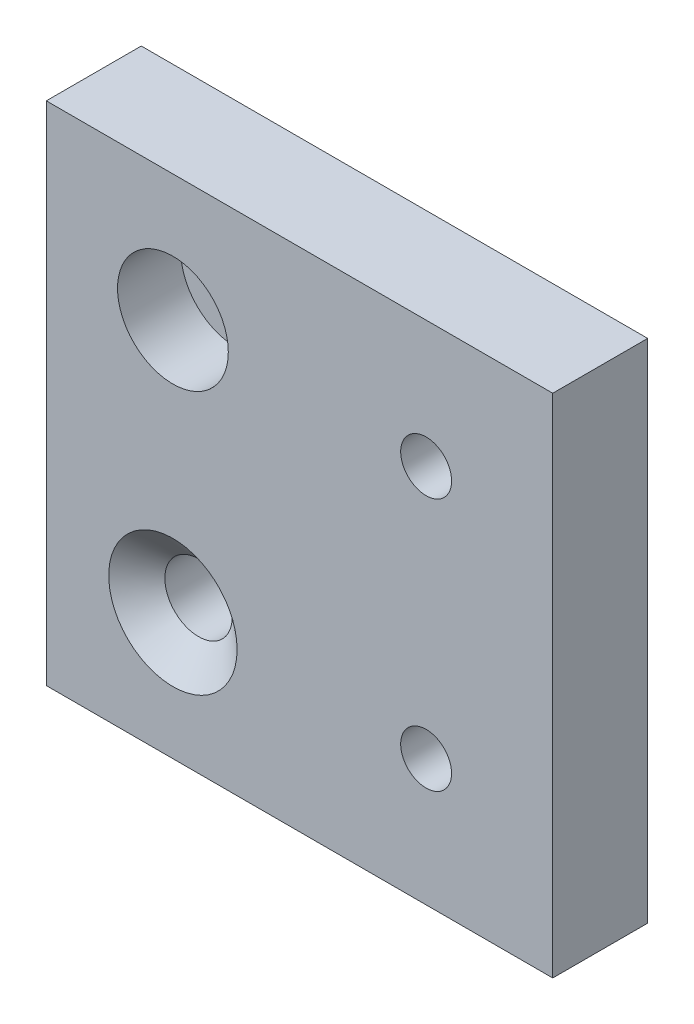
ISO-10303-21;
HEADER;
FILE_DESCRIPTION(('STEP AP214'),'2;1');
FILE_NAME('part.step','',(''),(''),'','','');
FILE_SCHEMA(('AUTOMOTIVE_DESIGN { 1 0 10303 214 1 1 1 1 }'));
ENDSEC;
DATA;
#1=APPLICATION_CONTEXT('core data for automotive mechanical design processes');
#2=APPLICATION_PROTOCOL_DEFINITION('international standard','automotive_design',2000,#1);
#3=PRODUCT_CONTEXT('',#1,'mechanical');
#4=PRODUCT('Part','Part','',(#3));
#5=PRODUCT_RELATED_PRODUCT_CATEGORY('part','',(#4));
#6=PRODUCT_DEFINITION_FORMATION('','',#4);
#7=PRODUCT_DEFINITION_CONTEXT('part definition',#1,'design');
#8=PRODUCT_DEFINITION('design','',#6,#7);
#9=PRODUCT_DEFINITION_SHAPE('','',#8);
#10=(LENGTH_UNIT() NAMED_UNIT(*) SI_UNIT(.MILLI.,.METRE.));
#11=(NAMED_UNIT(*) PLANE_ANGLE_UNIT() SI_UNIT($,.RADIAN.));
#12=(NAMED_UNIT(*) SI_UNIT($,.STERADIAN.) SOLID_ANGLE_UNIT());
#13=UNCERTAINTY_MEASURE_WITH_UNIT(LENGTH_MEASURE(1.E-05),#10,'distance_accuracy_value','');
#14=(GEOMETRIC_REPRESENTATION_CONTEXT(3) GLOBAL_UNCERTAINTY_ASSIGNED_CONTEXT((#13)) GLOBAL_UNIT_ASSIGNED_CONTEXT((#10,
#11,#12)) REPRESENTATION_CONTEXT('',''));
#15=CARTESIAN_POINT('',(0.,0.,0.));
#16=DIRECTION('',(0.,0.,1.));
#17=DIRECTION('',(1.,0.,0.));
#18=AXIS2_PLACEMENT_3D('',#15,#16,#17);
#19=CARTESIAN_POINT('',(0.,0.,9.525));
#20=DIRECTION('',(1.,0.,0.));
#21=DIRECTION('',(0.,0.,-1.));
#22=AXIS2_PLACEMENT_3D('',#19,#20,#21);
#23=PLANE('',#22);
#24=DIRECTION('',(0.,-1.,0.));
#25=VECTOR('',#24,1.);
#26=CARTESIAN_POINT('',(0.,0.,0.));
#27=LINE('',#26,#25);
#28=CARTESIAN_POINT('',(0.,50.8,0.));
#29=VERTEX_POINT('',#28);
#30=CARTESIAN_POINT('',(0.,0.,0.));
#31=VERTEX_POINT('',#30);
#32=EDGE_CURVE('E116',#29,#31,#27,.T.);
#33=ORIENTED_EDGE('',*,*,#32,.T.);
#34=DIRECTION('',(0.,0.,-1.));
#35=VECTOR('',#34,1.);
#36=CARTESIAN_POINT('',(0.,0.,9.525));
#37=LINE('',#36,#35);
#38=CARTESIAN_POINT('',(0.,0.,9.525));
#39=VERTEX_POINT('',#38);
#40=EDGE_CURVE('E11',#39,#31,#37,.T.);
#41=ORIENTED_EDGE('',*,*,#40,.F.);
#42=DIRECTION('',(0.,-1.,0.));
#43=VECTOR('',#42,1.);
#44=CARTESIAN_POINT('',(0.,0.,9.525));
#45=LINE('',#44,#43);
#46=CARTESIAN_POINT('',(0.,50.8,9.525));
#47=VERTEX_POINT('',#46);
#48=EDGE_CURVE('E98',#47,#39,#45,.T.);
#49=ORIENTED_EDGE('',*,*,#48,.F.);
#50=DIRECTION('',(0.,0.,-1.));
#51=VECTOR('',#50,1.);
#52=CARTESIAN_POINT('',(0.,50.8,9.525));
#53=LINE('',#52,#51);
#54=EDGE_CURVE('E112',#47,#29,#53,.T.);
#55=ORIENTED_EDGE('',*,*,#54,.T.);
#56=EDGE_LOOP('',(#33,#41,#49,#55));
#57=FACE_BOUND('',#56,.T.);
#58=ADVANCED_FACE('F46',(#57),#23,.F.);
#59=CARTESIAN_POINT('',(0.,0.,9.525));
#60=DIRECTION('',(0.,1.,0.));
#61=DIRECTION('',(0.,0.,1.));
#62=AXIS2_PLACEMENT_3D('',#59,#60,#61);
#63=PLANE('',#62);
#64=DIRECTION('',(1.,0.,0.));
#65=VECTOR('',#64,1.);
#66=CARTESIAN_POINT('',(0.,0.,0.));
#67=LINE('',#66,#65);
#68=CARTESIAN_POINT('',(50.8,0.,0.));
#69=VERTEX_POINT('',#68);
#70=EDGE_CURVE('E103',#31,#69,#67,.T.);
#71=ORIENTED_EDGE('',*,*,#70,.T.);
#72=DIRECTION('',(0.,0.,-1.));
#73=VECTOR('',#72,1.);
#74=CARTESIAN_POINT('',(50.8,0.,9.525));
#75=LINE('',#74,#73);
#76=CARTESIAN_POINT('',(50.8,0.,9.525));
#77=VERTEX_POINT('',#76);
#78=EDGE_CURVE('E55',#77,#69,#75,.T.);
#79=ORIENTED_EDGE('',*,*,#78,.F.);
#80=DIRECTION('',(1.,0.,0.));
#81=VECTOR('',#80,1.);
#82=CARTESIAN_POINT('',(0.,0.,9.525));
#83=LINE('',#82,#81);
#84=EDGE_CURVE('E93',#39,#77,#83,.T.);
#85=ORIENTED_EDGE('',*,*,#84,.F.);
#86=ORIENTED_EDGE('',*,*,#40,.T.);
#87=EDGE_LOOP('',(#71,#79,#85,#86));
#88=FACE_BOUND('',#87,.T.);
#89=ADVANCED_FACE('F102',(#88),#63,.F.);
#90=CARTESIAN_POINT('',(50.8,0.,9.525));
#91=DIRECTION('',(-1.,0.,0.));
#92=DIRECTION('',(0.,0.,1.));
#93=AXIS2_PLACEMENT_3D('',#90,#91,#92);
#94=PLANE('',#93);
#95=DIRECTION('',(0.,1.,0.));
#96=VECTOR('',#95,1.);
#97=CARTESIAN_POINT('',(50.8,0.,0.));
#98=LINE('',#97,#96);
#99=CARTESIAN_POINT('',(50.8,50.8,0.));
#100=VERTEX_POINT('',#99);
#101=EDGE_CURVE('E80',#69,#100,#98,.T.);
#102=ORIENTED_EDGE('',*,*,#101,.T.);
#103=DIRECTION('',(0.,0.,-1.));
#104=VECTOR('',#103,1.);
#105=CARTESIAN_POINT('',(50.8,50.8,9.525));
#106=LINE('',#105,#104);
#107=CARTESIAN_POINT('',(50.8,50.8,9.525));
#108=VERTEX_POINT('',#107);
#109=EDGE_CURVE('E105',#108,#100,#106,.T.);
#110=ORIENTED_EDGE('',*,*,#109,.F.);
#111=DIRECTION('',(0.,1.,0.));
#112=VECTOR('',#111,1.);
#113=CARTESIAN_POINT('',(50.8,0.,9.525));
#114=LINE('',#113,#112);
#115=EDGE_CURVE('E96',#77,#108,#114,.T.);
#116=ORIENTED_EDGE('',*,*,#115,.F.);
#117=ORIENTED_EDGE('',*,*,#78,.T.);
#118=EDGE_LOOP('',(#102,#110,#116,#117));
#119=FACE_BOUND('',#118,.T.);
#120=ADVANCED_FACE('F106',(#119),#94,.F.);
#121=CARTESIAN_POINT('',(0.,50.8,9.525));
#122=DIRECTION('',(0.,-1.,0.));
#123=DIRECTION('',(0.,0.,-1.));
#124=AXIS2_PLACEMENT_3D('',#121,#122,#123);
#125=PLANE('',#124);
#126=DIRECTION('',(-1.,0.,0.));
#127=VECTOR('',#126,1.);
#128=CARTESIAN_POINT('',(0.,50.8,0.));
#129=LINE('',#128,#127);
#130=EDGE_CURVE('E86',#100,#29,#129,.T.);
#131=ORIENTED_EDGE('',*,*,#130,.T.);
#132=ORIENTED_EDGE('',*,*,#54,.F.);
#133=DIRECTION('',(-1.,0.,0.));
#134=VECTOR('',#133,1.);
#135=CARTESIAN_POINT('',(0.,50.8,9.525));
#136=LINE('',#135,#134);
#137=EDGE_CURVE('E63',#108,#47,#136,.T.);
#138=ORIENTED_EDGE('',*,*,#137,.F.);
#139=ORIENTED_EDGE('',*,*,#109,.T.);
#140=EDGE_LOOP('',(#131,#132,#138,#139));
#141=FACE_BOUND('',#140,.T.);
#142=ADVANCED_FACE('F132',(#141),#125,.F.);
#143=CARTESIAN_POINT('',(0.,0.,9.525));
#144=DIRECTION('',(0.,0.,-1.));
#145=DIRECTION('',(-1.,0.,0.));
#146=AXIS2_PLACEMENT_3D('',#143,#144,#145);
#147=PLANE('',#146);
#148=CARTESIAN_POINT('',(12.7,12.7,9.525));
#149=DIRECTION('',(0.,0.,1.));
#150=DIRECTION('',(1.,0.,0.));
#151=AXIS2_PLACEMENT_3D('',#148,#149,#150);
#152=CIRCLE('',#151,6.4389);
#153=CARTESIAN_POINT('',(19.1389,12.7,9.525));
#154=VERTEX_POINT('',#153);
#155=EDGE_CURVE('E180',#154,#154,#152,.T.);
#156=ORIENTED_EDGE('',*,*,#155,.F.);
#157=EDGE_LOOP('',(#156));
#158=FACE_BOUND('',#157,.T.);
#159=CARTESIAN_POINT('',(38.1,38.1,9.525));
#160=DIRECTION('',(0.,0.,1.));
#161=DIRECTION('',(1.,0.,0.));
#162=AXIS2_PLACEMENT_3D('',#159,#160,#161);
#163=CIRCLE('',#162,2.5527);
#164=CARTESIAN_POINT('',(40.6527,38.1,9.525));
#165=VERTEX_POINT('',#164);
#166=EDGE_CURVE('E168',#165,#165,#163,.T.);
#167=ORIENTED_EDGE('',*,*,#166,.F.);
#168=EDGE_LOOP('',(#167));
#169=FACE_BOUND('',#168,.T.);
#170=CARTESIAN_POINT('',(38.1,12.7,9.525));
#171=DIRECTION('',(0.,0.,1.));
#172=DIRECTION('',(1.,0.,0.));
#173=AXIS2_PLACEMENT_3D('',#170,#171,#172);
#174=CIRCLE('',#173,2.5527);
#175=CARTESIAN_POINT('',(40.6527,12.7,9.525));
#176=VERTEX_POINT('',#175);
#177=EDGE_CURVE('E160',#176,#176,#174,.T.);
#178=ORIENTED_EDGE('',*,*,#177,.F.);
#179=EDGE_LOOP('',(#178));
#180=FACE_BOUND('',#179,.T.);
#181=CARTESIAN_POINT('',(12.7,38.1,9.525));
#182=DIRECTION('',(0.,0.,1.));
#183=DIRECTION('',(1.,0.,0.));
#184=AXIS2_PLACEMENT_3D('',#181,#182,#183);
#185=CIRCLE('',#184,5.55625);
#186=CARTESIAN_POINT('',(18.25625,38.1,9.525));
#187=VERTEX_POINT('',#186);
#188=EDGE_CURVE('E152',#187,#187,#185,.T.);
#189=ORIENTED_EDGE('',*,*,#188,.F.);
#190=EDGE_LOOP('',(#189));
#191=FACE_BOUND('',#190,.T.);
#192=ORIENTED_EDGE('',*,*,#48,.T.);
#193=ORIENTED_EDGE('',*,*,#84,.T.);
#194=ORIENTED_EDGE('',*,*,#115,.T.);
#195=ORIENTED_EDGE('',*,*,#137,.T.);
#196=EDGE_LOOP('',(#192,#193,#194,#195));
#197=FACE_BOUND('',#196,.T.);
#198=ADVANCED_FACE('F94',(#158,#169,#180,#191,#197),#147,.F.);
#199=CARTESIAN_POINT('',(0.,0.,0.));
#200=DIRECTION('',(0.,0.,-1.));
#201=DIRECTION('',(-1.,0.,0.));
#202=AXIS2_PLACEMENT_3D('',#199,#200,#201);
#203=PLANE('',#202);
#204=CARTESIAN_POINT('',(12.7,12.7,0.));
#205=DIRECTION('',(0.,0.,1.));
#206=DIRECTION('',(1.,0.,0.));
#207=AXIS2_PLACEMENT_3D('',#204,#205,#206);
#208=CIRCLE('',#207,3.3782);
#209=CARTESIAN_POINT('',(16.0782,12.7,0.));
#210=VERTEX_POINT('',#209);
#211=EDGE_CURVE('E172',#210,#210,#208,.T.);
#212=ORIENTED_EDGE('',*,*,#211,.T.);
#213=EDGE_LOOP('',(#212));
#214=FACE_BOUND('',#213,.T.);
#215=CARTESIAN_POINT('',(38.1,38.1,0.));
#216=DIRECTION('',(0.,0.,1.));
#217=DIRECTION('',(1.,0.,0.));
#218=AXIS2_PLACEMENT_3D('',#215,#216,#217);
#219=CIRCLE('',#218,2.5527);
#220=CARTESIAN_POINT('',(40.6527,38.1,0.));
#221=VERTEX_POINT('',#220);
#222=EDGE_CURVE('E164',#221,#221,#219,.T.);
#223=ORIENTED_EDGE('',*,*,#222,.T.);
#224=EDGE_LOOP('',(#223));
#225=FACE_BOUND('',#224,.T.);
#226=CARTESIAN_POINT('',(38.1,12.7,0.));
#227=DIRECTION('',(0.,0.,1.));
#228=DIRECTION('',(1.,0.,0.));
#229=AXIS2_PLACEMENT_3D('',#226,#227,#228);
#230=CIRCLE('',#229,2.5527);
#231=CARTESIAN_POINT('',(40.6527,12.7,0.));
#232=VERTEX_POINT('',#231);
#233=EDGE_CURVE('E156',#232,#232,#230,.T.);
#234=ORIENTED_EDGE('',*,*,#233,.T.);
#235=EDGE_LOOP('',(#234));
#236=FACE_BOUND('',#235,.T.);
#237=CARTESIAN_POINT('',(12.7,38.1,0.));
#238=DIRECTION('',(0.,0.,1.));
#239=DIRECTION('',(1.,0.,0.));
#240=AXIS2_PLACEMENT_3D('',#237,#238,#239);
#241=CIRCLE('',#240,3.3782);
#242=CARTESIAN_POINT('',(16.0782,38.1,0.));
#243=VERTEX_POINT('',#242);
#244=EDGE_CURVE('E120',#243,#243,#241,.T.);
#245=ORIENTED_EDGE('',*,*,#244,.T.);
#246=EDGE_LOOP('',(#245));
#247=FACE_BOUND('',#246,.T.);
#248=ORIENTED_EDGE('',*,*,#32,.F.);
#249=ORIENTED_EDGE('',*,*,#130,.F.);
#250=ORIENTED_EDGE('',*,*,#101,.F.);
#251=ORIENTED_EDGE('',*,*,#70,.F.);
#252=EDGE_LOOP('',(#248,#249,#250,#251));
#253=FACE_BOUND('',#252,.T.);
#254=ADVANCED_FACE('F135',(#214,#225,#236,#247,#253),#203,.T.);
#255=CARTESIAN_POINT('',(12.7,38.1,9.525));
#256=DIRECTION('',(0.,0.,1.));
#257=DIRECTION('',(1.,0.,0.));
#258=AXIS2_PLACEMENT_3D('',#255,#256,#257);
#259=CYLINDRICAL_SURFACE('',#258,3.3782);
#260=ORIENTED_EDGE('',*,*,#244,.F.);
#261=EDGE_LOOP('',(#260));
#262=FACE_BOUND('',#261,.T.);
#263=CARTESIAN_POINT('',(12.7,38.1,3.175));
#264=DIRECTION('',(0.,0.,1.));
#265=DIRECTION('',(1.,0.,0.));
#266=AXIS2_PLACEMENT_3D('',#263,#264,#265);
#267=CIRCLE('',#266,3.3782);
#268=CARTESIAN_POINT('',(16.0782,38.1,3.175));
#269=VERTEX_POINT('',#268);
#270=EDGE_CURVE('E144',#269,#269,#267,.T.);
#271=ORIENTED_EDGE('',*,*,#270,.T.);
#272=EDGE_LOOP('',(#271));
#273=FACE_BOUND('',#272,.T.);
#274=ADVANCED_FACE('F211',(#262,#273),#259,.F.);
#275=CARTESIAN_POINT('',(16.0782,38.1,3.175));
#276=DIRECTION('',(0.,0.,-1.));
#277=DIRECTION('',(-1.,0.,0.));
#278=AXIS2_PLACEMENT_3D('',#275,#276,#277);
#279=PLANE('',#278);
#280=ORIENTED_EDGE('',*,*,#270,.F.);
#281=EDGE_LOOP('',(#280));
#282=FACE_BOUND('',#281,.T.);
#283=CARTESIAN_POINT('',(12.7,38.1,3.175));
#284=DIRECTION('',(0.,0.,1.));
#285=DIRECTION('',(1.,0.,0.));
#286=AXIS2_PLACEMENT_3D('',#283,#284,#285);
#287=CIRCLE('',#286,5.55625);
#288=CARTESIAN_POINT('',(18.25625,38.1,3.175));
#289=VERTEX_POINT('',#288);
#290=EDGE_CURVE('E148',#289,#289,#287,.T.);
#291=ORIENTED_EDGE('',*,*,#290,.T.);
#292=EDGE_LOOP('',(#291));
#293=FACE_BOUND('',#292,.T.);
#294=ADVANCED_FACE('F201',(#282,#293),#279,.F.);
#295=CARTESIAN_POINT('',(12.7,38.1,9.525));
#296=DIRECTION('',(0.,0.,1.));
#297=DIRECTION('',(1.,0.,0.));
#298=AXIS2_PLACEMENT_3D('',#295,#296,#297);
#299=CYLINDRICAL_SURFACE('',#298,5.55625);
#300=ORIENTED_EDGE('',*,*,#290,.F.);
#301=EDGE_LOOP('',(#300));
#302=FACE_BOUND('',#301,.T.);
#303=ORIENTED_EDGE('',*,*,#188,.T.);
#304=EDGE_LOOP('',(#303));
#305=FACE_BOUND('',#304,.T.);
#306=ADVANCED_FACE('F198',(#302,#305),#299,.F.);
#307=CARTESIAN_POINT('',(38.1,12.7,9.525));
#308=DIRECTION('',(0.,0.,1.));
#309=DIRECTION('',(1.,0.,0.));
#310=AXIS2_PLACEMENT_3D('',#307,#308,#309);
#311=CYLINDRICAL_SURFACE('',#310,2.5527);
#312=ORIENTED_EDGE('',*,*,#233,.F.);
#313=EDGE_LOOP('',(#312));
#314=FACE_BOUND('',#313,.T.);
#315=ORIENTED_EDGE('',*,*,#177,.T.);
#316=EDGE_LOOP('',(#315));
#317=FACE_BOUND('',#316,.T.);
#318=ADVANCED_FACE('F200',(#314,#317),#311,.F.);
#319=CARTESIAN_POINT('',(38.1,38.1,9.525));
#320=DIRECTION('',(0.,0.,1.));
#321=DIRECTION('',(1.,0.,0.));
#322=AXIS2_PLACEMENT_3D('',#319,#320,#321);
#323=CYLINDRICAL_SURFACE('',#322,2.5527);
#324=ORIENTED_EDGE('',*,*,#222,.F.);
#325=EDGE_LOOP('',(#324));
#326=FACE_BOUND('',#325,.T.);
#327=ORIENTED_EDGE('',*,*,#166,.T.);
#328=EDGE_LOOP('',(#327));
#329=FACE_BOUND('',#328,.T.);
#330=ADVANCED_FACE('F208',(#326,#329),#323,.F.);
#331=CARTESIAN_POINT('',(12.7,12.7,9.525));
#332=DIRECTION('',(0.,0.,1.));
#333=DIRECTION('',(1.,0.,0.));
#334=AXIS2_PLACEMENT_3D('',#331,#332,#333);
#335=CYLINDRICAL_SURFACE('',#334,3.3782);
#336=ORIENTED_EDGE('',*,*,#211,.F.);
#337=EDGE_LOOP('',(#336));
#338=FACE_BOUND('',#337,.T.);
#339=CARTESIAN_POINT('',(12.7,12.7,6.95676775885569));
#340=DIRECTION('',(0.,0.,1.));
#341=DIRECTION('',(1.,0.,0.));
#342=AXIS2_PLACEMENT_3D('',#339,#340,#341);
#343=CIRCLE('',#342,3.3782);
#344=CARTESIAN_POINT('',(16.0782,12.7,6.95676775885569));
#345=VERTEX_POINT('',#344);
#346=EDGE_CURVE('E176',#345,#345,#343,.T.);
#347=ORIENTED_EDGE('',*,*,#346,.T.);
#348=EDGE_LOOP('',(#347));
#349=FACE_BOUND('',#348,.T.);
#350=ADVANCED_FACE('F267',(#338,#349),#335,.F.);
#351=CARTESIAN_POINT('',(12.7,12.7,9.525));
#352=DIRECTION('',(0.,0.,1.));
#353=DIRECTION('',(1.,0.,0.));
#354=AXIS2_PLACEMENT_3D('',#351,#352,#353);
#355=CONICAL_SURFACE('',#354,6.4389,0.872664625997164);
#356=ORIENTED_EDGE('',*,*,#346,.F.);
#357=EDGE_LOOP('',(#356));
#358=FACE_BOUND('',#357,.T.);
#359=ORIENTED_EDGE('',*,*,#155,.T.);
#360=EDGE_LOOP('',(#359));
#361=FACE_BOUND('',#360,.T.);
#362=ADVANCED_FACE('F187',(#358,#361),#355,.F.);
#363=CLOSED_SHELL('',(#58,#89,#120,#142,#198,#254,#274,#294,#306,#318,#330,#350,#362));
#364=MANIFOLD_SOLID_BREP('B2',#363);
#365=ADVANCED_BREP_SHAPE_REPRESENTATION('',(#18,#364),#14);
#366=SHAPE_DEFINITION_REPRESENTATION(#9,#365);
ENDSEC;
END-ISO-10303-21;
